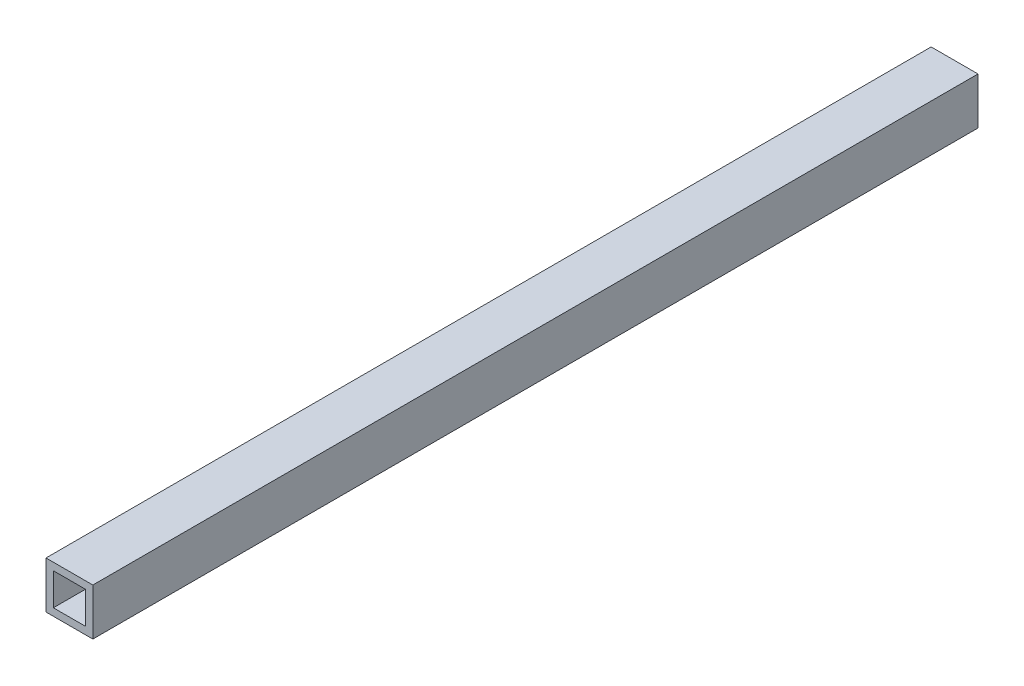
ISO-10303-21;
HEADER;
FILE_DESCRIPTION(('STEP AP214'),'2;1');
FILE_NAME('part.step','',(''),(''),'','','');
FILE_SCHEMA(('AUTOMOTIVE_DESIGN { 1 0 10303 214 1 1 1 1 }'));
ENDSEC;
DATA;
#1=APPLICATION_CONTEXT('core data for automotive mechanical design processes');
#2=APPLICATION_PROTOCOL_DEFINITION('international standard','automotive_design',2000,#1);
#3=PRODUCT_CONTEXT('',#1,'mechanical');
#4=PRODUCT('Part','Part','',(#3));
#5=PRODUCT_RELATED_PRODUCT_CATEGORY('part','',(#4));
#6=PRODUCT_DEFINITION_FORMATION('','',#4);
#7=PRODUCT_DEFINITION_CONTEXT('part definition',#1,'design');
#8=PRODUCT_DEFINITION('design','',#6,#7);
#9=PRODUCT_DEFINITION_SHAPE('','',#8);
#10=(LENGTH_UNIT() NAMED_UNIT(*) SI_UNIT(.MILLI.,.METRE.));
#11=(NAMED_UNIT(*) PLANE_ANGLE_UNIT() SI_UNIT($,.RADIAN.));
#12=(NAMED_UNIT(*) SI_UNIT($,.STERADIAN.) SOLID_ANGLE_UNIT());
#13=UNCERTAINTY_MEASURE_WITH_UNIT(LENGTH_MEASURE(1.E-05),#10,'distance_accuracy_value','');
#14=(GEOMETRIC_REPRESENTATION_CONTEXT(3) GLOBAL_UNCERTAINTY_ASSIGNED_CONTEXT((#13)) GLOBAL_UNIT_ASSIGNED_CONTEXT((#10,
#11,#12)) REPRESENTATION_CONTEXT('',''));
#15=CARTESIAN_POINT('',(0.,0.,0.));
#16=DIRECTION('',(0.,0.,1.));
#17=DIRECTION('',(1.,0.,0.));
#18=AXIS2_PLACEMENT_3D('',#15,#16,#17);
#19=CARTESIAN_POINT('',(0.,0.,240.));
#20=DIRECTION('',(0.,0.,-1.));
#21=DIRECTION('',(-1.,0.,0.));
#22=AXIS2_PLACEMENT_3D('',#19,#20,#21);
#23=PLANE('',#22);
#24=DIRECTION('',(0.,-1.,0.));
#25=VECTOR('',#24,1.);
#26=CARTESIAN_POINT('',(-6.35,6.35,240.));
#27=LINE('',#26,#25);
#28=CARTESIAN_POINT('',(-6.35,6.35,240.));
#29=VERTEX_POINT('',#28);
#30=CARTESIAN_POINT('',(-6.35,-6.35,240.));
#31=VERTEX_POINT('',#30);
#32=EDGE_CURVE('E157',#29,#31,#27,.T.);
#33=ORIENTED_EDGE('',*,*,#32,.T.);
#34=DIRECTION('',(1.,0.,0.));
#35=VECTOR('',#34,1.);
#36=CARTESIAN_POINT('',(6.35,-6.35,240.));
#37=LINE('',#36,#35);
#38=CARTESIAN_POINT('',(6.35,-6.35,240.));
#39=VERTEX_POINT('',#38);
#40=EDGE_CURVE('E161',#31,#39,#37,.T.);
#41=ORIENTED_EDGE('',*,*,#40,.T.);
#42=DIRECTION('',(0.,1.,0.));
#43=VECTOR('',#42,1.);
#44=CARTESIAN_POINT('',(6.35,6.35,240.));
#45=LINE('',#44,#43);
#46=CARTESIAN_POINT('',(6.35,6.35,240.));
#47=VERTEX_POINT('',#46);
#48=EDGE_CURVE('E165',#39,#47,#45,.T.);
#49=ORIENTED_EDGE('',*,*,#48,.T.);
#50=DIRECTION('',(-1.,0.,0.));
#51=VECTOR('',#50,1.);
#52=CARTESIAN_POINT('',(6.35,6.35,240.));
#53=LINE('',#52,#51);
#54=EDGE_CURVE('E168',#47,#29,#53,.T.);
#55=ORIENTED_EDGE('',*,*,#54,.T.);
#56=EDGE_LOOP('',(#33,#41,#49,#55));
#57=FACE_BOUND('',#56,.T.);
#58=DIRECTION('',(0.,1.,0.));
#59=VECTOR('',#58,1.);
#60=CARTESIAN_POINT('',(4.35,4.35,240.));
#61=LINE('',#60,#59);
#62=CARTESIAN_POINT('',(4.35,-4.35,240.));
#63=VERTEX_POINT('',#62);
#64=CARTESIAN_POINT('',(4.35,4.35,240.));
#65=VERTEX_POINT('',#64);
#66=EDGE_CURVE('E109',#63,#65,#61,.T.);
#67=ORIENTED_EDGE('',*,*,#66,.F.);
#68=DIRECTION('',(1.,0.,0.));
#69=VECTOR('',#68,1.);
#70=CARTESIAN_POINT('',(4.35,-4.35,240.));
#71=LINE('',#70,#69);
#72=CARTESIAN_POINT('',(-4.35,-4.35,240.));
#73=VERTEX_POINT('',#72);
#74=EDGE_CURVE('E135',#73,#63,#71,.T.);
#75=ORIENTED_EDGE('',*,*,#74,.F.);
#76=DIRECTION('',(0.,-1.,0.));
#77=VECTOR('',#76,1.);
#78=CARTESIAN_POINT('',(-4.35,4.35,240.));
#79=LINE('',#78,#77);
#80=CARTESIAN_POINT('',(-4.35,4.35,240.));
#81=VERTEX_POINT('',#80);
#82=EDGE_CURVE('E131',#81,#73,#79,.T.);
#83=ORIENTED_EDGE('',*,*,#82,.F.);
#84=DIRECTION('',(-1.,0.,0.));
#85=VECTOR('',#84,1.);
#86=CARTESIAN_POINT('',(4.35,4.35,240.));
#87=LINE('',#86,#85);
#88=EDGE_CURVE('E118',#65,#81,#87,.T.);
#89=ORIENTED_EDGE('',*,*,#88,.F.);
#90=EDGE_LOOP('',(#67,#75,#83,#89));
#91=FACE_BOUND('',#90,.T.);
#92=ADVANCED_FACE('F43',(#57,#91),#23,.F.);
#93=CARTESIAN_POINT('',(0.,0.,0.));
#94=DIRECTION('',(0.,0.,-1.));
#95=DIRECTION('',(-1.,0.,0.));
#96=AXIS2_PLACEMENT_3D('',#93,#94,#95);
#97=PLANE('',#96);
#98=DIRECTION('',(0.,-1.,0.));
#99=VECTOR('',#98,1.);
#100=CARTESIAN_POINT('',(-6.35,6.35,0.));
#101=LINE('',#100,#99);
#102=CARTESIAN_POINT('',(-6.35,6.35,0.));
#103=VERTEX_POINT('',#102);
#104=CARTESIAN_POINT('',(-6.35,-6.35,0.));
#105=VERTEX_POINT('',#104);
#106=EDGE_CURVE('E127',#103,#105,#101,.T.);
#107=ORIENTED_EDGE('',*,*,#106,.F.);
#108=DIRECTION('',(-1.,0.,0.));
#109=VECTOR('',#108,1.);
#110=CARTESIAN_POINT('',(6.35,6.35,0.));
#111=LINE('',#110,#109);
#112=CARTESIAN_POINT('',(6.35,6.35,0.));
#113=VERTEX_POINT('',#112);
#114=EDGE_CURVE('E162',#113,#103,#111,.T.);
#115=ORIENTED_EDGE('',*,*,#114,.F.);
#116=DIRECTION('',(0.,1.,0.));
#117=VECTOR('',#116,1.);
#118=CARTESIAN_POINT('',(6.35,6.35,0.));
#119=LINE('',#118,#117);
#120=CARTESIAN_POINT('',(6.35,-6.35,0.));
#121=VERTEX_POINT('',#120);
#122=EDGE_CURVE('E178',#121,#113,#119,.T.);
#123=ORIENTED_EDGE('',*,*,#122,.F.);
#124=DIRECTION('',(1.,0.,0.));
#125=VECTOR('',#124,1.);
#126=CARTESIAN_POINT('',(6.35,-6.35,0.));
#127=LINE('',#126,#125);
#128=EDGE_CURVE('E175',#105,#121,#127,.T.);
#129=ORIENTED_EDGE('',*,*,#128,.F.);
#130=EDGE_LOOP('',(#107,#115,#123,#129));
#131=FACE_BOUND('',#130,.T.);
#132=DIRECTION('',(1.,0.,0.));
#133=VECTOR('',#132,1.);
#134=CARTESIAN_POINT('',(4.35,-4.35,0.));
#135=LINE('',#134,#133);
#136=CARTESIAN_POINT('',(-4.35,-4.35,0.));
#137=VERTEX_POINT('',#136);
#138=CARTESIAN_POINT('',(4.35,-4.35,0.));
#139=VERTEX_POINT('',#138);
#140=EDGE_CURVE('E119',#137,#139,#135,.T.);
#141=ORIENTED_EDGE('',*,*,#140,.T.);
#142=DIRECTION('',(0.,1.,0.));
#143=VECTOR('',#142,1.);
#144=CARTESIAN_POINT('',(4.35,4.35,0.));
#145=LINE('',#144,#143);
#146=CARTESIAN_POINT('',(4.35,4.35,0.));
#147=VERTEX_POINT('',#146);
#148=EDGE_CURVE('E67',#139,#147,#145,.T.);
#149=ORIENTED_EDGE('',*,*,#148,.T.);
#150=DIRECTION('',(-1.,0.,0.));
#151=VECTOR('',#150,1.);
#152=CARTESIAN_POINT('',(4.35,4.35,0.));
#153=LINE('',#152,#151);
#154=CARTESIAN_POINT('',(-4.35,4.35,0.));
#155=VERTEX_POINT('',#154);
#156=EDGE_CURVE('E125',#147,#155,#153,.T.);
#157=ORIENTED_EDGE('',*,*,#156,.T.);
#158=DIRECTION('',(0.,-1.,0.));
#159=VECTOR('',#158,1.);
#160=CARTESIAN_POINT('',(-4.35,4.35,0.));
#161=LINE('',#160,#159);
#162=EDGE_CURVE('E144',#155,#137,#161,.T.);
#163=ORIENTED_EDGE('',*,*,#162,.T.);
#164=EDGE_LOOP('',(#141,#149,#157,#163));
#165=FACE_BOUND('',#164,.T.);
#166=ADVANCED_FACE('F201',(#131,#165),#97,.T.);
#167=CARTESIAN_POINT('',(-6.35,6.35,240.));
#168=DIRECTION('',(1.,0.,0.));
#169=DIRECTION('',(0.,1.,0.));
#170=AXIS2_PLACEMENT_3D('',#167,#168,#169);
#171=PLANE('',#170);
#172=ORIENTED_EDGE('',*,*,#106,.T.);
#173=DIRECTION('',(0.,0.,-1.));
#174=VECTOR('',#173,1.);
#175=CARTESIAN_POINT('',(-6.35,-6.35,240.));
#176=LINE('',#175,#174);
#177=EDGE_CURVE('E11',#31,#105,#176,.T.);
#178=ORIENTED_EDGE('',*,*,#177,.F.);
#179=ORIENTED_EDGE('',*,*,#32,.F.);
#180=DIRECTION('',(0.,0.,-1.));
#181=VECTOR('',#180,1.);
#182=CARTESIAN_POINT('',(-6.35,6.35,240.));
#183=LINE('',#182,#181);
#184=EDGE_CURVE('E171',#29,#103,#183,.T.);
#185=ORIENTED_EDGE('',*,*,#184,.T.);
#186=EDGE_LOOP('',(#172,#178,#179,#185));
#187=FACE_BOUND('',#186,.T.);
#188=ADVANCED_FACE('F45',(#187),#171,.F.);
#189=CARTESIAN_POINT('',(6.35,-6.35,240.));
#190=DIRECTION('',(0.,1.,0.));
#191=DIRECTION('',(-1.,0.,0.));
#192=AXIS2_PLACEMENT_3D('',#189,#190,#191);
#193=PLANE('',#192);
#194=ORIENTED_EDGE('',*,*,#128,.T.);
#195=DIRECTION('',(0.,0.,-1.));
#196=VECTOR('',#195,1.);
#197=CARTESIAN_POINT('',(6.35,-6.35,240.));
#198=LINE('',#197,#196);
#199=EDGE_CURVE('E52',#39,#121,#198,.T.);
#200=ORIENTED_EDGE('',*,*,#199,.F.);
#201=ORIENTED_EDGE('',*,*,#40,.F.);
#202=ORIENTED_EDGE('',*,*,#177,.T.);
#203=EDGE_LOOP('',(#194,#200,#201,#202));
#204=FACE_BOUND('',#203,.T.);
#205=ADVANCED_FACE('F211',(#204),#193,.F.);
#206=CARTESIAN_POINT('',(6.35,6.35,240.));
#207=DIRECTION('',(-1.,0.,0.));
#208=DIRECTION('',(0.,-1.,0.));
#209=AXIS2_PLACEMENT_3D('',#206,#207,#208);
#210=PLANE('',#209);
#211=ORIENTED_EDGE('',*,*,#122,.T.);
#212=DIRECTION('',(0.,0.,-1.));
#213=VECTOR('',#212,1.);
#214=CARTESIAN_POINT('',(6.35,6.35,240.));
#215=LINE('',#214,#213);
#216=EDGE_CURVE('E186',#47,#113,#215,.T.);
#217=ORIENTED_EDGE('',*,*,#216,.F.);
#218=ORIENTED_EDGE('',*,*,#48,.F.);
#219=ORIENTED_EDGE('',*,*,#199,.T.);
#220=EDGE_LOOP('',(#211,#217,#218,#219));
#221=FACE_BOUND('',#220,.T.);
#222=ADVANCED_FACE('F195',(#221),#210,.F.);
#223=CARTESIAN_POINT('',(6.35,6.35,240.));
#224=DIRECTION('',(0.,-1.,0.));
#225=DIRECTION('',(1.,0.,0.));
#226=AXIS2_PLACEMENT_3D('',#223,#224,#225);
#227=PLANE('',#226);
#228=ORIENTED_EDGE('',*,*,#114,.T.);
#229=ORIENTED_EDGE('',*,*,#184,.F.);
#230=ORIENTED_EDGE('',*,*,#54,.F.);
#231=ORIENTED_EDGE('',*,*,#216,.T.);
#232=EDGE_LOOP('',(#228,#229,#230,#231));
#233=FACE_BOUND('',#232,.T.);
#234=ADVANCED_FACE('F205',(#233),#227,.F.);
#235=CARTESIAN_POINT('',(4.35,4.35,240.));
#236=DIRECTION('',(-1.,0.,0.));
#237=DIRECTION('',(0.,-1.,0.));
#238=AXIS2_PLACEMENT_3D('',#235,#236,#237);
#239=PLANE('',#238);
#240=ORIENTED_EDGE('',*,*,#148,.F.);
#241=DIRECTION('',(0.,0.,-1.));
#242=VECTOR('',#241,1.);
#243=CARTESIAN_POINT('',(4.35,-4.35,240.));
#244=LINE('',#243,#242);
#245=EDGE_CURVE('E113',#63,#139,#244,.T.);
#246=ORIENTED_EDGE('',*,*,#245,.F.);
#247=ORIENTED_EDGE('',*,*,#66,.T.);
#248=DIRECTION('',(0.,0.,-1.));
#249=VECTOR('',#248,1.);
#250=CARTESIAN_POINT('',(4.35,4.35,240.));
#251=LINE('',#250,#249);
#252=EDGE_CURVE('E112',#65,#147,#251,.T.);
#253=ORIENTED_EDGE('',*,*,#252,.T.);
#254=EDGE_LOOP('',(#240,#246,#247,#253));
#255=FACE_BOUND('',#254,.T.);
#256=ADVANCED_FACE('F111',(#255),#239,.T.);
#257=CARTESIAN_POINT('',(4.35,4.35,240.));
#258=DIRECTION('',(0.,-1.,0.));
#259=DIRECTION('',(1.,0.,0.));
#260=AXIS2_PLACEMENT_3D('',#257,#258,#259);
#261=PLANE('',#260);
#262=ORIENTED_EDGE('',*,*,#156,.F.);
#263=ORIENTED_EDGE('',*,*,#252,.F.);
#264=ORIENTED_EDGE('',*,*,#88,.T.);
#265=DIRECTION('',(0.,0.,-1.));
#266=VECTOR('',#265,1.);
#267=CARTESIAN_POINT('',(-4.35,4.35,240.));
#268=LINE('',#267,#266);
#269=EDGE_CURVE('E128',#81,#155,#268,.T.);
#270=ORIENTED_EDGE('',*,*,#269,.T.);
#271=EDGE_LOOP('',(#262,#263,#264,#270));
#272=FACE_BOUND('',#271,.T.);
#273=ADVANCED_FACE('F122',(#272),#261,.T.);
#274=CARTESIAN_POINT('',(-4.35,4.35,240.));
#275=DIRECTION('',(1.,0.,0.));
#276=DIRECTION('',(0.,1.,0.));
#277=AXIS2_PLACEMENT_3D('',#274,#275,#276);
#278=PLANE('',#277);
#279=ORIENTED_EDGE('',*,*,#162,.F.);
#280=ORIENTED_EDGE('',*,*,#269,.F.);
#281=ORIENTED_EDGE('',*,*,#82,.T.);
#282=DIRECTION('',(0.,0.,-1.));
#283=VECTOR('',#282,1.);
#284=CARTESIAN_POINT('',(-4.35,-4.35,240.));
#285=LINE('',#284,#283);
#286=EDGE_CURVE('E59',#73,#137,#285,.T.);
#287=ORIENTED_EDGE('',*,*,#286,.T.);
#288=EDGE_LOOP('',(#279,#280,#281,#287));
#289=FACE_BOUND('',#288,.T.);
#290=ADVANCED_FACE('F234',(#289),#278,.T.);
#291=CARTESIAN_POINT('',(4.35,-4.35,240.));
#292=DIRECTION('',(0.,1.,0.));
#293=DIRECTION('',(-1.,0.,0.));
#294=AXIS2_PLACEMENT_3D('',#291,#292,#293);
#295=PLANE('',#294);
#296=ORIENTED_EDGE('',*,*,#140,.F.);
#297=ORIENTED_EDGE('',*,*,#286,.F.);
#298=ORIENTED_EDGE('',*,*,#74,.T.);
#299=ORIENTED_EDGE('',*,*,#245,.T.);
#300=EDGE_LOOP('',(#296,#297,#298,#299));
#301=FACE_BOUND('',#300,.T.);
#302=ADVANCED_FACE('F238',(#301),#295,.T.);
#303=CLOSED_SHELL('',(#92,#166,#188,#205,#222,#234,#256,#273,#290,#302));
#304=MANIFOLD_SOLID_BREP('B2',#303);
#305=ADVANCED_BREP_SHAPE_REPRESENTATION('',(#18,#304),#14);
#306=SHAPE_DEFINITION_REPRESENTATION(#9,#305);
ENDSEC;
END-ISO-10303-21;
